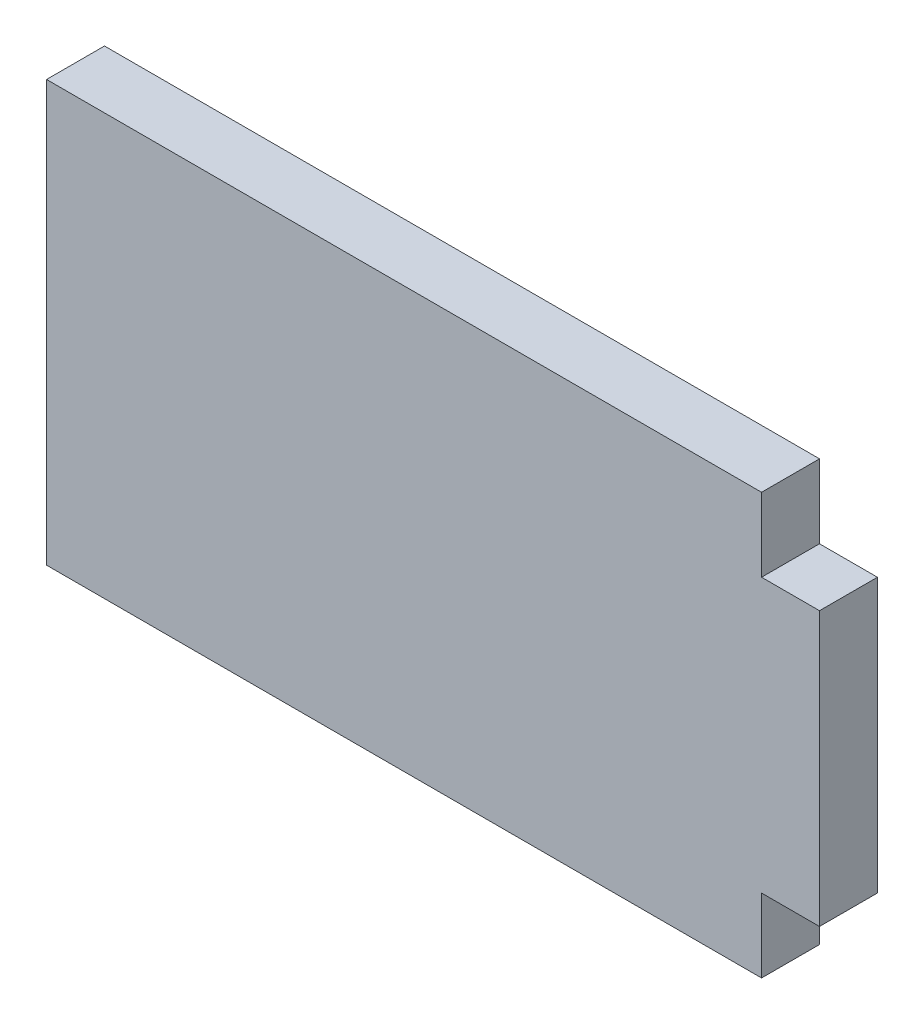
ISO-10303-21;
HEADER;
FILE_DESCRIPTION(('STEP AP214'),'2;1');
FILE_NAME('part.step','',(''),(''),'','','');
FILE_SCHEMA(('AUTOMOTIVE_DESIGN { 1 0 10303 214 1 1 1 1 }'));
ENDSEC;
DATA;
#1=APPLICATION_CONTEXT('core data for automotive mechanical design processes');
#2=APPLICATION_PROTOCOL_DEFINITION('international standard','automotive_design',2000,#1);
#3=PRODUCT_CONTEXT('',#1,'mechanical');
#4=PRODUCT('Part','Part','',(#3));
#5=PRODUCT_RELATED_PRODUCT_CATEGORY('part','',(#4));
#6=PRODUCT_DEFINITION_FORMATION('','',#4);
#7=PRODUCT_DEFINITION_CONTEXT('part definition',#1,'design');
#8=PRODUCT_DEFINITION('design','',#6,#7);
#9=PRODUCT_DEFINITION_SHAPE('','',#8);
#10=(LENGTH_UNIT() NAMED_UNIT(*) SI_UNIT(.MILLI.,.METRE.));
#11=(NAMED_UNIT(*) PLANE_ANGLE_UNIT() SI_UNIT($,.RADIAN.));
#12=(NAMED_UNIT(*) SI_UNIT($,.STERADIAN.) SOLID_ANGLE_UNIT());
#13=UNCERTAINTY_MEASURE_WITH_UNIT(LENGTH_MEASURE(1.E-05),#10,'distance_accuracy_value','');
#14=(GEOMETRIC_REPRESENTATION_CONTEXT(3) GLOBAL_UNCERTAINTY_ASSIGNED_CONTEXT((#13)) GLOBAL_UNIT_ASSIGNED_CONTEXT((#10,
#11,#12)) REPRESENTATION_CONTEXT('',''));
#15=CARTESIAN_POINT('',(0.,0.,0.));
#16=DIRECTION('',(0.,0.,1.));
#17=DIRECTION('',(1.,0.,0.));
#18=AXIS2_PLACEMENT_3D('',#15,#16,#17);
#19=CARTESIAN_POINT('',(0.,0.,3.));
#20=DIRECTION('',(1.,0.,0.));
#21=DIRECTION('',(0.,0.,-1.));
#22=AXIS2_PLACEMENT_3D('',#19,#20,#21);
#23=PLANE('',#22);
#24=DIRECTION('',(0.,-1.,0.));
#25=VECTOR('',#24,1.);
#26=CARTESIAN_POINT('',(0.,0.,0.));
#27=LINE('',#26,#25);
#28=CARTESIAN_POINT('',(0.,21.78,0.));
#29=VERTEX_POINT('',#28);
#30=CARTESIAN_POINT('',(0.,0.,0.));
#31=VERTEX_POINT('',#30);
#32=EDGE_CURVE('E129',#29,#31,#27,.T.);
#33=ORIENTED_EDGE('',*,*,#32,.T.);
#34=DIRECTION('',(0.,0.,-1.));
#35=VECTOR('',#34,1.);
#36=CARTESIAN_POINT('',(0.,0.,3.));
#37=LINE('',#36,#35);
#38=CARTESIAN_POINT('',(0.,0.,3.));
#39=VERTEX_POINT('',#38);
#40=EDGE_CURVE('E11',#39,#31,#37,.T.);
#41=ORIENTED_EDGE('',*,*,#40,.F.);
#42=DIRECTION('',(0.,-1.,0.));
#43=VECTOR('',#42,1.);
#44=CARTESIAN_POINT('',(0.,0.,3.));
#45=LINE('',#44,#43);
#46=CARTESIAN_POINT('',(0.,21.78,3.));
#47=VERTEX_POINT('',#46);
#48=EDGE_CURVE('E143',#47,#39,#45,.T.);
#49=ORIENTED_EDGE('',*,*,#48,.F.);
#50=DIRECTION('',(0.,0.,-1.));
#51=VECTOR('',#50,1.);
#52=CARTESIAN_POINT('',(0.,21.78,3.));
#53=LINE('',#52,#51);
#54=EDGE_CURVE('E125',#47,#29,#53,.T.);
#55=ORIENTED_EDGE('',*,*,#54,.T.);
#56=EDGE_LOOP('',(#33,#41,#49,#55));
#57=FACE_BOUND('',#56,.T.);
#58=ADVANCED_FACE('F33',(#57),#23,.F.);
#59=CARTESIAN_POINT('',(37.02,0.,3.));
#60=DIRECTION('',(0.,1.,0.));
#61=DIRECTION('',(0.,0.,1.));
#62=AXIS2_PLACEMENT_3D('',#59,#60,#61);
#63=PLANE('',#62);
#64=DIRECTION('',(1.,0.,0.));
#65=VECTOR('',#64,1.);
#66=CARTESIAN_POINT('',(37.02,0.,0.));
#67=LINE('',#66,#65);
#68=CARTESIAN_POINT('',(37.02,0.,0.));
#69=VERTEX_POINT('',#68);
#70=EDGE_CURVE('E132',#31,#69,#67,.T.);
#71=ORIENTED_EDGE('',*,*,#70,.T.);
#72=DIRECTION('',(0.,0.,-1.));
#73=VECTOR('',#72,1.);
#74=CARTESIAN_POINT('',(37.02,0.,3.));
#75=LINE('',#74,#73);
#76=CARTESIAN_POINT('',(37.02,0.,3.));
#77=VERTEX_POINT('',#76);
#78=EDGE_CURVE('E41',#77,#69,#75,.T.);
#79=ORIENTED_EDGE('',*,*,#78,.F.);
#80=DIRECTION('',(1.,0.,0.));
#81=VECTOR('',#80,1.);
#82=CARTESIAN_POINT('',(37.02,0.,3.));
#83=LINE('',#82,#81);
#84=EDGE_CURVE('E92',#39,#77,#83,.T.);
#85=ORIENTED_EDGE('',*,*,#84,.F.);
#86=ORIENTED_EDGE('',*,*,#40,.T.);
#87=EDGE_LOOP('',(#71,#79,#85,#86));
#88=FACE_BOUND('',#87,.T.);
#89=ADVANCED_FACE('F178',(#88),#63,.F.);
#90=CARTESIAN_POINT('',(37.02,3.81,3.));
#91=DIRECTION('',(-1.,0.,0.));
#92=DIRECTION('',(0.,0.,1.));
#93=AXIS2_PLACEMENT_3D('',#90,#91,#92);
#94=PLANE('',#93);
#95=DIRECTION('',(0.,1.,0.));
#96=VECTOR('',#95,1.);
#97=CARTESIAN_POINT('',(37.02,3.81,0.));
#98=LINE('',#97,#96);
#99=CARTESIAN_POINT('',(37.02,3.81,0.));
#100=VERTEX_POINT('',#99);
#101=EDGE_CURVE('E134',#69,#100,#98,.T.);
#102=ORIENTED_EDGE('',*,*,#101,.T.);
#103=DIRECTION('',(0.,0.,-1.));
#104=VECTOR('',#103,1.);
#105=CARTESIAN_POINT('',(37.02,3.81,3.));
#106=LINE('',#105,#104);
#107=CARTESIAN_POINT('',(37.02,3.81,3.));
#108=VERTEX_POINT('',#107);
#109=EDGE_CURVE('E150',#108,#100,#106,.T.);
#110=ORIENTED_EDGE('',*,*,#109,.F.);
#111=DIRECTION('',(0.,1.,0.));
#112=VECTOR('',#111,1.);
#113=CARTESIAN_POINT('',(37.02,3.81,3.));
#114=LINE('',#113,#112);
#115=EDGE_CURVE('E158',#77,#108,#114,.T.);
#116=ORIENTED_EDGE('',*,*,#115,.F.);
#117=ORIENTED_EDGE('',*,*,#78,.T.);
#118=EDGE_LOOP('',(#102,#110,#116,#117));
#119=FACE_BOUND('',#118,.T.);
#120=ADVANCED_FACE('F156',(#119),#94,.F.);
#121=CARTESIAN_POINT('',(40.02,3.81,3.));
#122=DIRECTION('',(0.,1.,0.));
#123=DIRECTION('',(-1.,0.,0.));
#124=AXIS2_PLACEMENT_3D('',#121,#122,#123);
#125=PLANE('',#124);
#126=DIRECTION('',(1.,0.,0.));
#127=VECTOR('',#126,1.);
#128=CARTESIAN_POINT('',(40.02,3.81,0.));
#129=LINE('',#128,#127);
#130=CARTESIAN_POINT('',(40.02,3.81,0.));
#131=VERTEX_POINT('',#130);
#132=EDGE_CURVE('E136',#100,#131,#129,.T.);
#133=ORIENTED_EDGE('',*,*,#132,.T.);
#134=DIRECTION('',(0.,0.,-1.));
#135=VECTOR('',#134,1.);
#136=CARTESIAN_POINT('',(40.02,3.81,3.));
#137=LINE('',#136,#135);
#138=CARTESIAN_POINT('',(40.02,3.81,3.));
#139=VERTEX_POINT('',#138);
#140=EDGE_CURVE('E147',#139,#131,#137,.T.);
#141=ORIENTED_EDGE('',*,*,#140,.F.);
#142=DIRECTION('',(1.,0.,0.));
#143=VECTOR('',#142,1.);
#144=CARTESIAN_POINT('',(40.02,3.81,3.));
#145=LINE('',#144,#143);
#146=EDGE_CURVE('E170',#108,#139,#145,.T.);
#147=ORIENTED_EDGE('',*,*,#146,.F.);
#148=ORIENTED_EDGE('',*,*,#109,.T.);
#149=EDGE_LOOP('',(#133,#141,#147,#148));
#150=FACE_BOUND('',#149,.T.);
#151=ADVANCED_FACE('F166',(#150),#125,.F.);
#152=CARTESIAN_POINT('',(40.02,17.97,3.));
#153=DIRECTION('',(-1.,0.,0.));
#154=DIRECTION('',(0.,0.,1.));
#155=AXIS2_PLACEMENT_3D('',#152,#153,#154);
#156=PLANE('',#155);
#157=DIRECTION('',(0.,1.,0.));
#158=VECTOR('',#157,1.);
#159=CARTESIAN_POINT('',(40.02,17.97,0.));
#160=LINE('',#159,#158);
#161=CARTESIAN_POINT('',(40.02,17.97,0.));
#162=VERTEX_POINT('',#161);
#163=EDGE_CURVE('E138',#131,#162,#160,.T.);
#164=ORIENTED_EDGE('',*,*,#163,.T.);
#165=DIRECTION('',(0.,0.,-1.));
#166=VECTOR('',#165,1.);
#167=CARTESIAN_POINT('',(40.02,17.97,3.));
#168=LINE('',#167,#166);
#169=CARTESIAN_POINT('',(40.02,17.97,3.));
#170=VERTEX_POINT('',#169);
#171=EDGE_CURVE('E120',#170,#162,#168,.T.);
#172=ORIENTED_EDGE('',*,*,#171,.F.);
#173=DIRECTION('',(0.,1.,0.));
#174=VECTOR('',#173,1.);
#175=CARTESIAN_POINT('',(40.02,17.97,3.));
#176=LINE('',#175,#174);
#177=EDGE_CURVE('E111',#139,#170,#176,.T.);
#178=ORIENTED_EDGE('',*,*,#177,.F.);
#179=ORIENTED_EDGE('',*,*,#140,.T.);
#180=EDGE_LOOP('',(#164,#172,#178,#179));
#181=FACE_BOUND('',#180,.T.);
#182=ADVANCED_FACE('F169',(#181),#156,.F.);
#183=CARTESIAN_POINT('',(37.02,17.97,3.));
#184=DIRECTION('',(0.,-1.,0.));
#185=DIRECTION('',(0.,0.,-1.));
#186=AXIS2_PLACEMENT_3D('',#183,#184,#185);
#187=PLANE('',#186);
#188=DIRECTION('',(-1.,0.,0.));
#189=VECTOR('',#188,1.);
#190=CARTESIAN_POINT('',(37.02,17.97,0.));
#191=LINE('',#190,#189);
#192=CARTESIAN_POINT('',(37.02,17.97,0.));
#193=VERTEX_POINT('',#192);
#194=EDGE_CURVE('E119',#162,#193,#191,.T.);
#195=ORIENTED_EDGE('',*,*,#194,.T.);
#196=DIRECTION('',(0.,0.,-1.));
#197=VECTOR('',#196,1.);
#198=CARTESIAN_POINT('',(37.02,17.97,3.));
#199=LINE('',#198,#197);
#200=CARTESIAN_POINT('',(37.02,17.97,3.));
#201=VERTEX_POINT('',#200);
#202=EDGE_CURVE('E116',#201,#193,#199,.T.);
#203=ORIENTED_EDGE('',*,*,#202,.F.);
#204=DIRECTION('',(-1.,0.,0.));
#205=VECTOR('',#204,1.);
#206=CARTESIAN_POINT('',(37.02,17.97,3.));
#207=LINE('',#206,#205);
#208=EDGE_CURVE('E105',#170,#201,#207,.T.);
#209=ORIENTED_EDGE('',*,*,#208,.F.);
#210=ORIENTED_EDGE('',*,*,#171,.T.);
#211=EDGE_LOOP('',(#195,#203,#209,#210));
#212=FACE_BOUND('',#211,.T.);
#213=ADVANCED_FACE('F117',(#212),#187,.F.);
#214=CARTESIAN_POINT('',(37.02,21.78,3.));
#215=DIRECTION('',(-1.,0.,0.));
#216=DIRECTION('',(0.,-1.,0.));
#217=AXIS2_PLACEMENT_3D('',#214,#215,#216);
#218=PLANE('',#217);
#219=DIRECTION('',(0.,1.,0.));
#220=VECTOR('',#219,1.);
#221=CARTESIAN_POINT('',(37.02,21.78,0.));
#222=LINE('',#221,#220);
#223=CARTESIAN_POINT('',(37.02,21.78,0.));
#224=VERTEX_POINT('',#223);
#225=EDGE_CURVE('E78',#193,#224,#222,.T.);
#226=ORIENTED_EDGE('',*,*,#225,.T.);
#227=DIRECTION('',(0.,0.,-1.));
#228=VECTOR('',#227,1.);
#229=CARTESIAN_POINT('',(37.02,21.78,3.));
#230=LINE('',#229,#228);
#231=CARTESIAN_POINT('',(37.02,21.78,3.));
#232=VERTEX_POINT('',#231);
#233=EDGE_CURVE('E121',#232,#224,#230,.T.);
#234=ORIENTED_EDGE('',*,*,#233,.F.);
#235=DIRECTION('',(0.,1.,0.));
#236=VECTOR('',#235,1.);
#237=CARTESIAN_POINT('',(37.02,21.78,3.));
#238=LINE('',#237,#236);
#239=EDGE_CURVE('E109',#201,#232,#238,.T.);
#240=ORIENTED_EDGE('',*,*,#239,.F.);
#241=ORIENTED_EDGE('',*,*,#202,.T.);
#242=EDGE_LOOP('',(#226,#234,#240,#241));
#243=FACE_BOUND('',#242,.T.);
#244=ADVANCED_FACE('F123',(#243),#218,.F.);
#245=CARTESIAN_POINT('',(0.,21.78,3.));
#246=DIRECTION('',(0.,-1.,0.));
#247=DIRECTION('',(0.,0.,-1.));
#248=AXIS2_PLACEMENT_3D('',#245,#246,#247);
#249=PLANE('',#248);
#250=DIRECTION('',(-1.,0.,0.));
#251=VECTOR('',#250,1.);
#252=CARTESIAN_POINT('',(0.,21.78,0.));
#253=LINE('',#252,#251);
#254=EDGE_CURVE('E84',#224,#29,#253,.T.);
#255=ORIENTED_EDGE('',*,*,#254,.T.);
#256=ORIENTED_EDGE('',*,*,#54,.F.);
#257=DIRECTION('',(-1.,0.,0.));
#258=VECTOR('',#257,1.);
#259=CARTESIAN_POINT('',(0.,21.78,3.));
#260=LINE('',#259,#258);
#261=EDGE_CURVE('E49',#232,#47,#260,.T.);
#262=ORIENTED_EDGE('',*,*,#261,.F.);
#263=ORIENTED_EDGE('',*,*,#233,.T.);
#264=EDGE_LOOP('',(#255,#256,#262,#263));
#265=FACE_BOUND('',#264,.T.);
#266=ADVANCED_FACE('F194',(#265),#249,.F.);
#267=CARTESIAN_POINT('',(0.,0.,3.));
#268=DIRECTION('',(0.,0.,-1.));
#269=DIRECTION('',(-1.,0.,0.));
#270=AXIS2_PLACEMENT_3D('',#267,#268,#269);
#271=PLANE('',#270);
#272=ORIENTED_EDGE('',*,*,#48,.T.);
#273=ORIENTED_EDGE('',*,*,#84,.T.);
#274=ORIENTED_EDGE('',*,*,#115,.T.);
#275=ORIENTED_EDGE('',*,*,#146,.T.);
#276=ORIENTED_EDGE('',*,*,#177,.T.);
#277=ORIENTED_EDGE('',*,*,#208,.T.);
#278=ORIENTED_EDGE('',*,*,#239,.T.);
#279=ORIENTED_EDGE('',*,*,#261,.T.);
#280=EDGE_LOOP('',(#272,#273,#274,#275,#276,#277,#278,#279));
#281=FACE_BOUND('',#280,.T.);
#282=ADVANCED_FACE('F107',(#281),#271,.F.);
#283=CARTESIAN_POINT('',(0.,0.,0.));
#284=DIRECTION('',(0.,0.,-1.));
#285=DIRECTION('',(-1.,0.,0.));
#286=AXIS2_PLACEMENT_3D('',#283,#284,#285);
#287=PLANE('',#286);
#288=ORIENTED_EDGE('',*,*,#32,.F.);
#289=ORIENTED_EDGE('',*,*,#254,.F.);
#290=ORIENTED_EDGE('',*,*,#225,.F.);
#291=ORIENTED_EDGE('',*,*,#194,.F.);
#292=ORIENTED_EDGE('',*,*,#163,.F.);
#293=ORIENTED_EDGE('',*,*,#132,.F.);
#294=ORIENTED_EDGE('',*,*,#101,.F.);
#295=ORIENTED_EDGE('',*,*,#70,.F.);
#296=EDGE_LOOP('',(#288,#289,#290,#291,#292,#293,#294,#295));
#297=FACE_BOUND('',#296,.T.);
#298=ADVANCED_FACE('F162',(#297),#287,.T.);
#299=CLOSED_SHELL('',(#58,#89,#120,#151,#182,#213,#244,#266,#282,#298));
#300=MANIFOLD_SOLID_BREP('B2',#299);
#301=ADVANCED_BREP_SHAPE_REPRESENTATION('',(#18,#300),#14);
#302=SHAPE_DEFINITION_REPRESENTATION(#9,#301);
ENDSEC;
END-ISO-10303-21;
